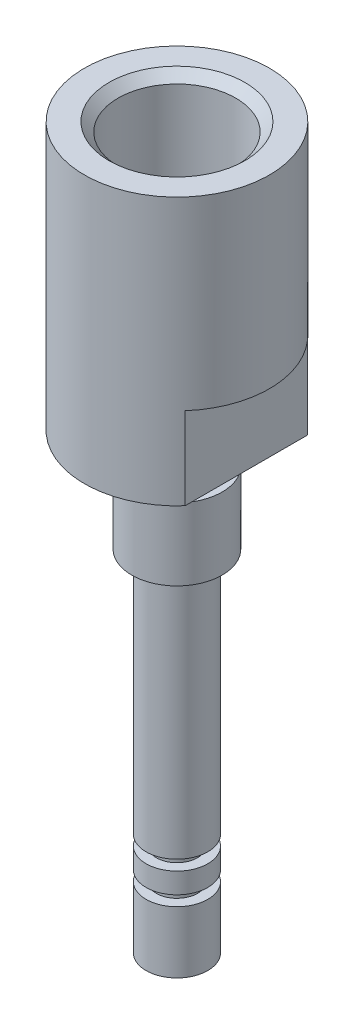
ISO-10303-21;
HEADER;
FILE_DESCRIPTION(('STEP AP214'),'2;1');
FILE_NAME('part.step','',(''),(''),'','','');
FILE_SCHEMA(('AUTOMOTIVE_DESIGN { 1 0 10303 214 1 1 1 1 }'));
ENDSEC;
DATA;
#1=APPLICATION_CONTEXT('core data for automotive mechanical design processes');
#2=APPLICATION_PROTOCOL_DEFINITION('international standard','automotive_design',2000,#1);
#3=PRODUCT_CONTEXT('',#1,'mechanical');
#4=PRODUCT('Part','Part','',(#3));
#5=PRODUCT_RELATED_PRODUCT_CATEGORY('part','',(#4));
#6=PRODUCT_DEFINITION_FORMATION('','',#4);
#7=PRODUCT_DEFINITION_CONTEXT('part definition',#1,'design');
#8=PRODUCT_DEFINITION('design','',#6,#7);
#9=PRODUCT_DEFINITION_SHAPE('','',#8);
#10=(LENGTH_UNIT() NAMED_UNIT(*) SI_UNIT(.MILLI.,.METRE.));
#11=(NAMED_UNIT(*) PLANE_ANGLE_UNIT() SI_UNIT($,.RADIAN.));
#12=(NAMED_UNIT(*) SI_UNIT($,.STERADIAN.) SOLID_ANGLE_UNIT());
#13=UNCERTAINTY_MEASURE_WITH_UNIT(LENGTH_MEASURE(1.E-05),#10,'distance_accuracy_value','');
#14=(GEOMETRIC_REPRESENTATION_CONTEXT(3) GLOBAL_UNCERTAINTY_ASSIGNED_CONTEXT((#13)) GLOBAL_UNIT_ASSIGNED_CONTEXT((#10,
#11,#12)) REPRESENTATION_CONTEXT('',''));
#15=CARTESIAN_POINT('',(0.,0.,0.));
#16=DIRECTION('',(0.,0.,1.));
#17=DIRECTION('',(1.,0.,0.));
#18=AXIS2_PLACEMENT_3D('',#15,#16,#17);
#19=CARTESIAN_POINT('',(-0.75,70.,0.));
#20=DIRECTION('',(0.,-1.,0.));
#21=DIRECTION('',(0.,0.,-1.));
#22=AXIS2_PLACEMENT_3D('',#19,#20,#21);
#23=PLANE('',#22);
#24=CARTESIAN_POINT('',(0.,70.,0.));
#25=DIRECTION('',(0.,-1.,0.));
#26=DIRECTION('',(0.,0.,-1.));
#27=AXIS2_PLACEMENT_3D('',#24,#25,#26);
#28=CIRCLE('',#27,9.);
#29=CARTESIAN_POINT('',(0.,70.,-9.));
#30=VERTEX_POINT('',#29);
#31=EDGE_CURVE('E116',#30,#30,#28,.T.);
#32=ORIENTED_EDGE('',*,*,#31,.F.);
#33=EDGE_LOOP('',(#32));
#34=FACE_BOUND('',#33,.T.);
#35=CARTESIAN_POINT('',(0.,70.,0.));
#36=DIRECTION('',(0.,1.,0.));
#37=DIRECTION('',(0.,0.,1.));
#38=AXIS2_PLACEMENT_3D('',#35,#36,#37);
#39=CIRCLE('',#38,6.6035);
#40=CARTESIAN_POINT('',(0.,70.,6.6035));
#41=VERTEX_POINT('',#40);
#42=EDGE_CURVE('E159',#41,#41,#39,.T.);
#43=ORIENTED_EDGE('',*,*,#42,.F.);
#44=EDGE_LOOP('',(#43));
#45=FACE_BOUND('',#44,.T.);
#46=ADVANCED_FACE('F47',(#34,#45),#23,.F.);
#47=CARTESIAN_POINT('',(0.,0.,0.));
#48=DIRECTION('',(0.,-1.,0.));
#49=DIRECTION('',(0.,0.,-1.));
#50=AXIS2_PLACEMENT_3D('',#47,#48,#49);
#51=CYLINDRICAL_SURFACE('',#50,0.75);
#52=CARTESIAN_POINT('',(0.,0.,0.));
#53=DIRECTION('',(0.,-1.,0.));
#54=DIRECTION('',(0.,0.,-1.));
#55=AXIS2_PLACEMENT_3D('',#52,#53,#54);
#56=CIRCLE('',#55,0.75);
#57=CARTESIAN_POINT('',(0.,0.,-0.75));
#58=VERTEX_POINT('',#57);
#59=EDGE_CURVE('E99',#58,#58,#56,.T.);
#60=ORIENTED_EDGE('',*,*,#59,.T.);
#61=EDGE_LOOP('',(#60));
#62=FACE_BOUND('',#61,.T.);
#63=CARTESIAN_POINT('',(0.,5.,0.));
#64=DIRECTION('',(0.,1.,0.));
#65=DIRECTION('',(0.,0.,1.));
#66=AXIS2_PLACEMENT_3D('',#63,#64,#65);
#67=CIRCLE('',#66,0.75);
#68=CARTESIAN_POINT('',(0.,5.,0.75));
#69=VERTEX_POINT('',#68);
#70=EDGE_CURVE('E128',#69,#69,#67,.F.);
#71=ORIENTED_EDGE('',*,*,#70,.F.);
#72=EDGE_LOOP('',(#71));
#73=FACE_BOUND('',#72,.T.);
#74=ADVANCED_FACE('F238',(#62,#73),#51,.F.);
#75=CARTESIAN_POINT('',(-3.,0.,0.));
#76=DIRECTION('',(0.,1.,0.));
#77=DIRECTION('',(0.,0.,1.));
#78=AXIS2_PLACEMENT_3D('',#75,#76,#77);
#79=PLANE('',#78);
#80=ORIENTED_EDGE('',*,*,#59,.F.);
#81=EDGE_LOOP('',(#80));
#82=FACE_BOUND('',#81,.T.);
#83=CARTESIAN_POINT('',(0.,0.,0.));
#84=DIRECTION('',(0.,-1.,0.));
#85=DIRECTION('',(0.,0.,-1.));
#86=AXIS2_PLACEMENT_3D('',#83,#84,#85);
#87=CIRCLE('',#86,3.);
#88=CARTESIAN_POINT('',(0.,0.,-3.));
#89=VERTEX_POINT('',#88);
#90=EDGE_CURVE('E132',#89,#89,#87,.T.);
#91=ORIENTED_EDGE('',*,*,#90,.T.);
#92=EDGE_LOOP('',(#91));
#93=FACE_BOUND('',#92,.T.);
#94=ADVANCED_FACE('F49',(#82,#93),#79,.F.);
#95=CARTESIAN_POINT('',(0.,0.,0.));
#96=DIRECTION('',(0.,-1.,0.));
#97=DIRECTION('',(0.,0.,-1.));
#98=AXIS2_PLACEMENT_3D('',#95,#96,#97);
#99=CYLINDRICAL_SURFACE('',#98,9.);
#100=CARTESIAN_POINT('',(0.,52.,0.));
#101=DIRECTION('',(0.,1.,0.));
#102=DIRECTION('',(0.,0.,1.));
#103=AXIS2_PLACEMENT_3D('',#100,#101,#102);
#104=CIRCLE('',#103,9.);
#105=CARTESIAN_POINT('',(-6.75,52.,-5.95294044989533));
#106=VERTEX_POINT('',#105);
#107=CARTESIAN_POINT('',(-6.75,52.,5.95294044989533));
#108=VERTEX_POINT('',#107);
#109=EDGE_CURVE('E12',#106,#108,#104,.T.);
#110=ORIENTED_EDGE('',*,*,#109,.T.);
#111=DIRECTION('',(0.,-1.,0.));
#112=VECTOR('',#111,1.);
#113=CARTESIAN_POINT('',(-6.75,0.,5.95294044989533));
#114=LINE('',#113,#112);
#115=CARTESIAN_POINT('',(-6.75,44.,5.95294044989532));
#116=VERTEX_POINT('',#115);
#117=EDGE_CURVE('E156',#108,#116,#114,.T.);
#118=ORIENTED_EDGE('',*,*,#117,.T.);
#119=CARTESIAN_POINT('',(0.,44.,0.));
#120=DIRECTION('',(0.,-1.,0.));
#121=DIRECTION('',(0.,0.,-1.));
#122=AXIS2_PLACEMENT_3D('',#119,#120,#121);
#123=CIRCLE('',#122,9.);
#124=CARTESIAN_POINT('',(6.75,44.,5.95294044989533));
#125=VERTEX_POINT('',#124);
#126=EDGE_CURVE('E111',#125,#116,#123,.T.);
#127=ORIENTED_EDGE('',*,*,#126,.F.);
#128=DIRECTION('',(0.,-1.,0.));
#129=VECTOR('',#128,1.);
#130=CARTESIAN_POINT('',(6.75,0.,5.95294044989533));
#131=LINE('',#130,#129);
#132=CARTESIAN_POINT('',(6.75,52.,5.95294044989533));
#133=VERTEX_POINT('',#132);
#134=EDGE_CURVE('E71',#125,#133,#131,.F.);
#135=ORIENTED_EDGE('',*,*,#134,.T.);
#136=CARTESIAN_POINT('',(0.,52.,0.));
#137=DIRECTION('',(0.,-1.,0.));
#138=DIRECTION('',(0.,0.,-1.));
#139=AXIS2_PLACEMENT_3D('',#136,#137,#138);
#140=CIRCLE('',#139,9.);
#141=CARTESIAN_POINT('',(6.75,52.,-5.95294044989533));
#142=VERTEX_POINT('',#141);
#143=EDGE_CURVE('E56',#142,#133,#140,.T.);
#144=ORIENTED_EDGE('',*,*,#143,.F.);
#145=DIRECTION('',(0.,-1.,0.));
#146=VECTOR('',#145,1.);
#147=CARTESIAN_POINT('',(6.75,0.,-5.95294044989533));
#148=LINE('',#147,#146);
#149=CARTESIAN_POINT('',(6.75,44.,-5.95294044989533));
#150=VERTEX_POINT('',#149);
#151=EDGE_CURVE('E91',#142,#150,#148,.T.);
#152=ORIENTED_EDGE('',*,*,#151,.T.);
#153=CARTESIAN_POINT('',(-6.75,44.,-5.95294044989532));
#154=VERTEX_POINT('',#153);
#155=EDGE_CURVE('E106',#154,#150,#123,.T.);
#156=ORIENTED_EDGE('',*,*,#155,.F.);
#157=DIRECTION('',(0.,-1.,0.));
#158=VECTOR('',#157,1.);
#159=CARTESIAN_POINT('',(-6.75,0.,-5.95294044989533));
#160=LINE('',#159,#158);
#161=EDGE_CURVE('E63',#154,#106,#160,.F.);
#162=ORIENTED_EDGE('',*,*,#161,.T.);
#163=EDGE_LOOP('',(#110,#118,#127,#135,#144,#152,#156,#162));
#164=FACE_BOUND('',#163,.T.);
#165=ORIENTED_EDGE('',*,*,#31,.T.);
#166=EDGE_LOOP('',(#165));
#167=FACE_BOUND('',#166,.T.);
#168=ADVANCED_FACE('F104',(#164,#167),#99,.T.);
#169=CARTESIAN_POINT('',(-9.,44.,0.));
#170=DIRECTION('',(0.,1.,0.));
#171=DIRECTION('',(0.,0.,1.));
#172=AXIS2_PLACEMENT_3D('',#169,#170,#171);
#173=PLANE('',#172);
#174=CARTESIAN_POINT('',(0.,44.,0.));
#175=DIRECTION('',(0.,-1.,0.));
#176=DIRECTION('',(0.,0.,-1.));
#177=AXIS2_PLACEMENT_3D('',#174,#175,#176);
#178=CIRCLE('',#177,3.);
#179=CARTESIAN_POINT('',(0.,44.,-3.));
#180=VERTEX_POINT('',#179);
#181=EDGE_CURVE('E112',#180,#180,#178,.T.);
#182=ORIENTED_EDGE('',*,*,#181,.F.);
#183=EDGE_LOOP('',(#182));
#184=FACE_BOUND('',#183,.T.);
#185=ORIENTED_EDGE('',*,*,#126,.T.);
#186=DIRECTION('',(0.,0.,-1.));
#187=VECTOR('',#186,1.);
#188=CARTESIAN_POINT('',(-6.75,44.,0.));
#189=LINE('',#188,#187);
#190=EDGE_CURVE('E98',#116,#154,#189,.T.);
#191=ORIENTED_EDGE('',*,*,#190,.T.);
#192=ORIENTED_EDGE('',*,*,#155,.T.);
#193=DIRECTION('',(0.,0.,1.));
#194=VECTOR('',#193,1.);
#195=CARTESIAN_POINT('',(6.75,44.,0.));
#196=LINE('',#195,#194);
#197=EDGE_CURVE('E88',#150,#125,#196,.T.);
#198=ORIENTED_EDGE('',*,*,#197,.T.);
#199=EDGE_LOOP('',(#185,#191,#192,#198));
#200=FACE_BOUND('',#199,.T.);
#201=ADVANCED_FACE('F109',(#184,#200),#173,.F.);
#202=CARTESIAN_POINT('',(0.,0.,0.));
#203=DIRECTION('',(0.,-1.,0.));
#204=DIRECTION('',(0.,0.,-1.));
#205=AXIS2_PLACEMENT_3D('',#202,#203,#204);
#206=CYLINDRICAL_SURFACE('',#205,3.);
#207=CARTESIAN_POINT('',(0.,41.,0.));
#208=DIRECTION('',(0.,-1.,0.));
#209=DIRECTION('',(0.,0.,-1.));
#210=AXIS2_PLACEMENT_3D('',#207,#208,#209);
#211=CIRCLE('',#210,3.);
#212=CARTESIAN_POINT('',(0.,41.,-3.));
#213=VERTEX_POINT('',#212);
#214=EDGE_CURVE('E118',#213,#213,#211,.T.);
#215=ORIENTED_EDGE('',*,*,#214,.F.);
#216=EDGE_LOOP('',(#215));
#217=FACE_BOUND('',#216,.T.);
#218=ORIENTED_EDGE('',*,*,#181,.T.);
#219=EDGE_LOOP('',(#218));
#220=FACE_BOUND('',#219,.T.);
#221=ADVANCED_FACE('F225',(#217,#220),#206,.T.);
#222=CARTESIAN_POINT('',(-4.39603960629369,41.,0.));
#223=DIRECTION('',(0.,-1.,0.));
#224=DIRECTION('',(0.,0.,-1.));
#225=AXIS2_PLACEMENT_3D('',#222,#223,#224);
#226=PLANE('',#225);
#227=CARTESIAN_POINT('',(0.,41.,0.));
#228=DIRECTION('',(0.,-1.,0.));
#229=DIRECTION('',(0.,0.,-1.));
#230=AXIS2_PLACEMENT_3D('',#227,#228,#229);
#231=CIRCLE('',#230,4.39603960629369);
#232=CARTESIAN_POINT('',(0.,41.,-4.39603960629369));
#233=VERTEX_POINT('',#232);
#234=EDGE_CURVE('E216',#233,#233,#231,.T.);
#235=ORIENTED_EDGE('',*,*,#234,.F.);
#236=EDGE_LOOP('',(#235));
#237=FACE_BOUND('',#236,.T.);
#238=ORIENTED_EDGE('',*,*,#214,.T.);
#239=EDGE_LOOP('',(#238));
#240=FACE_BOUND('',#239,.T.);
#241=ADVANCED_FACE('F223',(#237,#240),#226,.F.);
#242=CARTESIAN_POINT('',(0.,0.,0.));
#243=DIRECTION('',(0.,-1.,0.));
#244=DIRECTION('',(0.,0.,-1.));
#245=AXIS2_PLACEMENT_3D('',#242,#243,#244);
#246=CYLINDRICAL_SURFACE('',#245,4.39603960629369);
#247=CARTESIAN_POINT('',(0.,34.,0.));
#248=DIRECTION('',(0.,-1.,0.));
#249=DIRECTION('',(0.,0.,-1.));
#250=AXIS2_PLACEMENT_3D('',#247,#248,#249);
#251=CIRCLE('',#250,4.39603960629369);
#252=CARTESIAN_POINT('',(0.,34.,-4.39603960629369));
#253=VERTEX_POINT('',#252);
#254=EDGE_CURVE('E212',#253,#253,#251,.T.);
#255=ORIENTED_EDGE('',*,*,#254,.F.);
#256=EDGE_LOOP('',(#255));
#257=FACE_BOUND('',#256,.T.);
#258=ORIENTED_EDGE('',*,*,#234,.T.);
#259=EDGE_LOOP('',(#258));
#260=FACE_BOUND('',#259,.T.);
#261=ADVANCED_FACE('F315',(#257,#260),#246,.T.);
#262=CARTESIAN_POINT('',(-4.39603960629369,34.,0.));
#263=DIRECTION('',(0.,1.,0.));
#264=DIRECTION('',(0.,0.,1.));
#265=AXIS2_PLACEMENT_3D('',#262,#263,#264);
#266=PLANE('',#265);
#267=CARTESIAN_POINT('',(0.,34.,0.));
#268=DIRECTION('',(0.,-1.,0.));
#269=DIRECTION('',(0.,0.,-1.));
#270=AXIS2_PLACEMENT_3D('',#267,#268,#269);
#271=CIRCLE('',#270,3.);
#272=CARTESIAN_POINT('',(0.,34.,-3.));
#273=VERTEX_POINT('',#272);
#274=EDGE_CURVE('E208',#273,#273,#271,.T.);
#275=ORIENTED_EDGE('',*,*,#274,.F.);
#276=EDGE_LOOP('',(#275));
#277=FACE_BOUND('',#276,.T.);
#278=ORIENTED_EDGE('',*,*,#254,.T.);
#279=EDGE_LOOP('',(#278));
#280=FACE_BOUND('',#279,.T.);
#281=ADVANCED_FACE('F311',(#277,#280),#266,.F.);
#282=CARTESIAN_POINT('',(0.,0.,0.));
#283=DIRECTION('',(0.,-1.,0.));
#284=DIRECTION('',(0.,0.,-1.));
#285=AXIS2_PLACEMENT_3D('',#282,#283,#284);
#286=CYLINDRICAL_SURFACE('',#285,3.);
#287=CARTESIAN_POINT('',(0.,10.,0.));
#288=DIRECTION('',(0.,-1.,0.));
#289=DIRECTION('',(0.,0.,-1.));
#290=AXIS2_PLACEMENT_3D('',#287,#288,#289);
#291=CIRCLE('',#290,3.);
#292=CARTESIAN_POINT('',(0.,10.,-3.));
#293=VERTEX_POINT('',#292);
#294=EDGE_CURVE('E204',#293,#293,#291,.T.);
#295=ORIENTED_EDGE('',*,*,#294,.F.);
#296=EDGE_LOOP('',(#295));
#297=FACE_BOUND('',#296,.T.);
#298=ORIENTED_EDGE('',*,*,#274,.T.);
#299=EDGE_LOOP('',(#298));
#300=FACE_BOUND('',#299,.T.);
#301=ADVANCED_FACE('F307',(#297,#300),#286,.T.);
#302=CARTESIAN_POINT('',(-3.,10.,0.));
#303=DIRECTION('',(0.,1.,0.));
#304=DIRECTION('',(0.,0.,1.));
#305=AXIS2_PLACEMENT_3D('',#302,#303,#304);
#306=PLANE('',#305);
#307=CARTESIAN_POINT('',(0.,10.,0.));
#308=DIRECTION('',(0.,-1.,0.));
#309=DIRECTION('',(0.,0.,-1.));
#310=AXIS2_PLACEMENT_3D('',#307,#308,#309);
#311=CIRCLE('',#310,2.);
#312=CARTESIAN_POINT('',(0.,10.,-2.));
#313=VERTEX_POINT('',#312);
#314=EDGE_CURVE('E200',#313,#313,#311,.T.);
#315=ORIENTED_EDGE('',*,*,#314,.F.);
#316=EDGE_LOOP('',(#315));
#317=FACE_BOUND('',#316,.T.);
#318=ORIENTED_EDGE('',*,*,#294,.T.);
#319=EDGE_LOOP('',(#318));
#320=FACE_BOUND('',#319,.T.);
#321=ADVANCED_FACE('F303',(#317,#320),#306,.F.);
#322=CARTESIAN_POINT('',(0.,0.,0.));
#323=DIRECTION('',(0.,-1.,0.));
#324=DIRECTION('',(0.,0.,-1.));
#325=AXIS2_PLACEMENT_3D('',#322,#323,#324);
#326=CYLINDRICAL_SURFACE('',#325,2.);
#327=CARTESIAN_POINT('',(0.,9.,0.));
#328=DIRECTION('',(0.,-1.,0.));
#329=DIRECTION('',(0.,0.,-1.));
#330=AXIS2_PLACEMENT_3D('',#327,#328,#329);
#331=CIRCLE('',#330,2.);
#332=CARTESIAN_POINT('',(0.,9.,-2.));
#333=VERTEX_POINT('',#332);
#334=EDGE_CURVE('E196',#333,#333,#331,.T.);
#335=ORIENTED_EDGE('',*,*,#334,.F.);
#336=EDGE_LOOP('',(#335));
#337=FACE_BOUND('',#336,.T.);
#338=ORIENTED_EDGE('',*,*,#314,.T.);
#339=EDGE_LOOP('',(#338));
#340=FACE_BOUND('',#339,.T.);
#341=ADVANCED_FACE('F299',(#337,#340),#326,.T.);
#342=CARTESIAN_POINT('',(-2.,9.,0.));
#343=DIRECTION('',(0.,-1.,0.));
#344=DIRECTION('',(0.,0.,-1.));
#345=AXIS2_PLACEMENT_3D('',#342,#343,#344);
#346=PLANE('',#345);
#347=CARTESIAN_POINT('',(0.,9.,0.));
#348=DIRECTION('',(0.,-1.,0.));
#349=DIRECTION('',(0.,0.,-1.));
#350=AXIS2_PLACEMENT_3D('',#347,#348,#349);
#351=CIRCLE('',#350,3.);
#352=CARTESIAN_POINT('',(0.,9.,-3.));
#353=VERTEX_POINT('',#352);
#354=EDGE_CURVE('E192',#353,#353,#351,.T.);
#355=ORIENTED_EDGE('',*,*,#354,.F.);
#356=EDGE_LOOP('',(#355));
#357=FACE_BOUND('',#356,.T.);
#358=ORIENTED_EDGE('',*,*,#334,.T.);
#359=EDGE_LOOP('',(#358));
#360=FACE_BOUND('',#359,.T.);
#361=ADVANCED_FACE('F295',(#357,#360),#346,.F.);
#362=CARTESIAN_POINT('',(0.,0.,0.));
#363=DIRECTION('',(0.,-1.,0.));
#364=DIRECTION('',(0.,0.,-1.));
#365=AXIS2_PLACEMENT_3D('',#362,#363,#364);
#366=CYLINDRICAL_SURFACE('',#365,3.);
#367=CARTESIAN_POINT('',(0.,7.,0.));
#368=DIRECTION('',(0.,-1.,0.));
#369=DIRECTION('',(0.,0.,-1.));
#370=AXIS2_PLACEMENT_3D('',#367,#368,#369);
#371=CIRCLE('',#370,3.);
#372=CARTESIAN_POINT('',(0.,7.,-3.));
#373=VERTEX_POINT('',#372);
#374=EDGE_CURVE('E188',#373,#373,#371,.T.);
#375=ORIENTED_EDGE('',*,*,#374,.F.);
#376=EDGE_LOOP('',(#375));
#377=FACE_BOUND('',#376,.T.);
#378=ORIENTED_EDGE('',*,*,#354,.T.);
#379=EDGE_LOOP('',(#378));
#380=FACE_BOUND('',#379,.T.);
#381=ADVANCED_FACE('F291',(#377,#380),#366,.T.);
#382=CARTESIAN_POINT('',(-3.,7.,0.));
#383=DIRECTION('',(0.,1.,0.));
#384=DIRECTION('',(0.,0.,1.));
#385=AXIS2_PLACEMENT_3D('',#382,#383,#384);
#386=PLANE('',#385);
#387=CARTESIAN_POINT('',(0.,7.,0.));
#388=DIRECTION('',(0.,-1.,0.));
#389=DIRECTION('',(0.,0.,-1.));
#390=AXIS2_PLACEMENT_3D('',#387,#388,#389);
#391=CIRCLE('',#390,2.);
#392=CARTESIAN_POINT('',(0.,7.,-2.));
#393=VERTEX_POINT('',#392);
#394=EDGE_CURVE('E184',#393,#393,#391,.T.);
#395=ORIENTED_EDGE('',*,*,#394,.F.);
#396=EDGE_LOOP('',(#395));
#397=FACE_BOUND('',#396,.T.);
#398=ORIENTED_EDGE('',*,*,#374,.T.);
#399=EDGE_LOOP('',(#398));
#400=FACE_BOUND('',#399,.T.);
#401=ADVANCED_FACE('F287',(#397,#400),#386,.F.);
#402=CARTESIAN_POINT('',(0.,0.,0.));
#403=DIRECTION('',(0.,-1.,0.));
#404=DIRECTION('',(0.,0.,-1.));
#405=AXIS2_PLACEMENT_3D('',#402,#403,#404);
#406=CYLINDRICAL_SURFACE('',#405,2.);
#407=CARTESIAN_POINT('',(0.,6.,0.));
#408=DIRECTION('',(0.,-1.,0.));
#409=DIRECTION('',(0.,0.,-1.));
#410=AXIS2_PLACEMENT_3D('',#407,#408,#409);
#411=CIRCLE('',#410,2.);
#412=CARTESIAN_POINT('',(0.,6.,-2.));
#413=VERTEX_POINT('',#412);
#414=EDGE_CURVE('E180',#413,#413,#411,.T.);
#415=ORIENTED_EDGE('',*,*,#414,.F.);
#416=EDGE_LOOP('',(#415));
#417=FACE_BOUND('',#416,.T.);
#418=ORIENTED_EDGE('',*,*,#394,.T.);
#419=EDGE_LOOP('',(#418));
#420=FACE_BOUND('',#419,.T.);
#421=ADVANCED_FACE('F283',(#417,#420),#406,.T.);
#422=CARTESIAN_POINT('',(-2.,6.,0.));
#423=DIRECTION('',(0.,-1.,0.));
#424=DIRECTION('',(0.,0.,-1.));
#425=AXIS2_PLACEMENT_3D('',#422,#423,#424);
#426=PLANE('',#425);
#427=CARTESIAN_POINT('',(0.,6.,0.));
#428=DIRECTION('',(0.,-1.,0.));
#429=DIRECTION('',(0.,0.,-1.));
#430=AXIS2_PLACEMENT_3D('',#427,#428,#429);
#431=CIRCLE('',#430,3.);
#432=CARTESIAN_POINT('',(0.,6.,-3.));
#433=VERTEX_POINT('',#432);
#434=EDGE_CURVE('E176',#433,#433,#431,.T.);
#435=ORIENTED_EDGE('',*,*,#434,.F.);
#436=EDGE_LOOP('',(#435));
#437=FACE_BOUND('',#436,.T.);
#438=ORIENTED_EDGE('',*,*,#414,.T.);
#439=EDGE_LOOP('',(#438));
#440=FACE_BOUND('',#439,.T.);
#441=ADVANCED_FACE('F279',(#437,#440),#426,.F.);
#442=CARTESIAN_POINT('',(0.,0.,0.));
#443=DIRECTION('',(0.,-1.,0.));
#444=DIRECTION('',(0.,0.,-1.));
#445=AXIS2_PLACEMENT_3D('',#442,#443,#444);
#446=CYLINDRICAL_SURFACE('',#445,3.);
#447=ORIENTED_EDGE('',*,*,#90,.F.);
#448=EDGE_LOOP('',(#447));
#449=FACE_BOUND('',#448,.T.);
#450=ORIENTED_EDGE('',*,*,#434,.T.);
#451=EDGE_LOOP('',(#450));
#452=FACE_BOUND('',#451,.T.);
#453=ADVANCED_FACE('F272',(#449,#452),#446,.T.);
#454=CARTESIAN_POINT('',(-3.,5.,0.));
#455=DIRECTION('',(0.,1.,0.));
#456=DIRECTION('',(0.,0.,1.));
#457=AXIS2_PLACEMENT_3D('',#454,#455,#456);
#458=PLANE('',#457);
#459=CARTESIAN_POINT('',(0.,5.,0.));
#460=DIRECTION('',(0.,1.,0.));
#461=DIRECTION('',(0.,0.,1.));
#462=AXIS2_PLACEMENT_3D('',#459,#460,#461);
#463=CIRCLE('',#462,1.5);
#464=CARTESIAN_POINT('',(0.,5.,1.5));
#465=VERTEX_POINT('',#464);
#466=EDGE_CURVE('E133',#465,#465,#463,.F.);
#467=ORIENTED_EDGE('',*,*,#466,.F.);
#468=EDGE_LOOP('',(#467));
#469=FACE_BOUND('',#468,.T.);
#470=ORIENTED_EDGE('',*,*,#70,.T.);
#471=EDGE_LOOP('',(#470));
#472=FACE_BOUND('',#471,.T.);
#473=ADVANCED_FACE('F269',(#469,#472),#458,.T.);
#474=CARTESIAN_POINT('',(0.,-4.2426406871193,0.));
#475=DIRECTION('',(0.,1.,0.));
#476=DIRECTION('',(0.,0.,1.));
#477=AXIS2_PLACEMENT_3D('',#474,#475,#476);
#478=CYLINDRICAL_SURFACE('',#477,1.5);
#479=CARTESIAN_POINT('',(0.,45.4628660361561,0.));
#480=DIRECTION('',(0.,1.,0.));
#481=DIRECTION('',(0.,0.,1.));
#482=AXIS2_PLACEMENT_3D('',#479,#480,#481);
#483=CIRCLE('',#482,1.5);
#484=CARTESIAN_POINT('',(0.,45.4628660361561,1.5));
#485=VERTEX_POINT('',#484);
#486=EDGE_CURVE('E134',#485,#485,#483,.T.);
#487=ORIENTED_EDGE('',*,*,#486,.T.);
#488=EDGE_LOOP('',(#487));
#489=FACE_BOUND('',#488,.T.);
#490=ORIENTED_EDGE('',*,*,#466,.T.);
#491=EDGE_LOOP('',(#490));
#492=FACE_BOUND('',#491,.T.);
#493=ADVANCED_FACE('F267',(#489,#492),#478,.F.);
#494=CARTESIAN_POINT('',(0.,48.,0.));
#495=DIRECTION('',(0.,1.,0.));
#496=DIRECTION('',(0.,0.,1.));
#497=AXIS2_PLACEMENT_3D('',#494,#495,#496);
#498=CONICAL_SURFACE('',#497,5.72249999999999,1.02974425867665);
#499=CARTESIAN_POINT('',(0.,48.,0.));
#500=DIRECTION('',(0.,1.,0.));
#501=DIRECTION('',(0.,0.,1.));
#502=AXIS2_PLACEMENT_3D('',#499,#500,#501);
#503=CIRCLE('',#502,5.72249999999999);
#504=CARTESIAN_POINT('',(0.,48.,5.72249999999999));
#505=VERTEX_POINT('',#504);
#506=EDGE_CURVE('E137',#505,#505,#503,.T.);
#507=ORIENTED_EDGE('',*,*,#506,.T.);
#508=EDGE_LOOP('',(#507));
#509=FACE_BOUND('',#508,.T.);
#510=ORIENTED_EDGE('',*,*,#486,.F.);
#511=EDGE_LOOP('',(#510));
#512=FACE_BOUND('',#511,.T.);
#513=ADVANCED_FACE('F259',(#509,#512),#498,.F.);
#514=CARTESIAN_POINT('',(0.,70.,0.));
#515=DIRECTION('',(0.,1.,0.));
#516=DIRECTION('',(0.,0.,1.));
#517=AXIS2_PLACEMENT_3D('',#514,#515,#516);
#518=CYLINDRICAL_SURFACE('',#517,5.7225);
#519=ORIENTED_EDGE('',*,*,#506,.F.);
#520=EDGE_LOOP('',(#519));
#521=FACE_BOUND('',#520,.T.);
#522=CARTESIAN_POINT('',(0.,69.119,0.));
#523=DIRECTION('',(0.,1.,0.));
#524=DIRECTION('',(0.,0.,1.));
#525=AXIS2_PLACEMENT_3D('',#522,#523,#524);
#526=CIRCLE('',#525,5.7225);
#527=CARTESIAN_POINT('',(0.,69.119,5.7225));
#528=VERTEX_POINT('',#527);
#529=EDGE_CURVE('E163',#528,#528,#526,.T.);
#530=ORIENTED_EDGE('',*,*,#529,.T.);
#531=EDGE_LOOP('',(#530));
#532=FACE_BOUND('',#531,.T.);
#533=ADVANCED_FACE('F251',(#521,#532),#518,.F.);
#534=CARTESIAN_POINT('',(0.,70.,0.));
#535=DIRECTION('',(0.,1.,0.));
#536=DIRECTION('',(0.,0.,1.));
#537=AXIS2_PLACEMENT_3D('',#534,#535,#536);
#538=CONICAL_SURFACE('',#537,6.6035,0.785398163397455);
#539=ORIENTED_EDGE('',*,*,#529,.F.);
#540=EDGE_LOOP('',(#539));
#541=FACE_BOUND('',#540,.T.);
#542=ORIENTED_EDGE('',*,*,#42,.T.);
#543=EDGE_LOOP('',(#542));
#544=FACE_BOUND('',#543,.T.);
#545=ADVANCED_FACE('F249',(#541,#544),#538,.F.);
#546=CARTESIAN_POINT('',(0.,52.,0.));
#547=DIRECTION('',(0.,-1.,0.));
#548=DIRECTION('',(0.,0.,-1.));
#549=AXIS2_PLACEMENT_3D('',#546,#547,#548);
#550=PLANE('',#549);
#551=ORIENTED_EDGE('',*,*,#143,.T.);
#552=DIRECTION('',(0.,0.,-1.));
#553=VECTOR('',#552,1.);
#554=CARTESIAN_POINT('',(6.75,52.,-8.03566917245019));
#555=LINE('',#554,#553);
#556=EDGE_CURVE('E143',#133,#142,#555,.T.);
#557=ORIENTED_EDGE('',*,*,#556,.T.);
#558=EDGE_LOOP('',(#551,#557));
#559=FACE_BOUND('',#558,.T.);
#560=ADVANCED_FACE('F142',(#559),#550,.T.);
#561=CARTESIAN_POINT('',(6.75,52.,-8.03566917245019));
#562=DIRECTION('',(-1.,0.,0.));
#563=DIRECTION('',(0.,0.,1.));
#564=AXIS2_PLACEMENT_3D('',#561,#562,#563);
#565=PLANE('',#564);
#566=ORIENTED_EDGE('',*,*,#556,.F.);
#567=ORIENTED_EDGE('',*,*,#134,.F.);
#568=ORIENTED_EDGE('',*,*,#197,.F.);
#569=ORIENTED_EDGE('',*,*,#151,.F.);
#570=EDGE_LOOP('',(#566,#567,#568,#569));
#571=FACE_BOUND('',#570,.T.);
#572=ADVANCED_FACE('F90',(#571),#565,.F.);
#573=CARTESIAN_POINT('',(0.,52.,0.));
#574=DIRECTION('',(0.,1.,0.));
#575=DIRECTION('',(0.,0.,1.));
#576=AXIS2_PLACEMENT_3D('',#573,#574,#575);
#577=PLANE('',#576);
#578=DIRECTION('',(0.,0.,1.));
#579=VECTOR('',#578,1.);
#580=CARTESIAN_POINT('',(-6.75,52.,-8.03566917245019));
#581=LINE('',#580,#579);
#582=EDGE_CURVE('E145',#106,#108,#581,.T.);
#583=ORIENTED_EDGE('',*,*,#582,.T.);
#584=ORIENTED_EDGE('',*,*,#109,.F.);
#585=EDGE_LOOP('',(#583,#584));
#586=FACE_BOUND('',#585,.T.);
#587=ADVANCED_FACE('F431',(#586),#577,.F.);
#588=CARTESIAN_POINT('',(-6.75,52.,-8.03566917245019));
#589=DIRECTION('',(1.,0.,0.));
#590=DIRECTION('',(0.,0.,-1.));
#591=AXIS2_PLACEMENT_3D('',#588,#589,#590);
#592=PLANE('',#591);
#593=ORIENTED_EDGE('',*,*,#582,.F.);
#594=ORIENTED_EDGE('',*,*,#161,.F.);
#595=ORIENTED_EDGE('',*,*,#190,.F.);
#596=ORIENTED_EDGE('',*,*,#117,.F.);
#597=EDGE_LOOP('',(#593,#594,#595,#596));
#598=FACE_BOUND('',#597,.T.);
#599=ADVANCED_FACE('F439',(#598),#592,.F.);
#600=CLOSED_SHELL('',(#46,#74,#94,#168,#201,#221,#241,#261,#281,#301,#321,#341,#361,#381,#401,
#421,#441,#453,#473,#493,#513,#533,#545,#560,#572,#587,#599));
#601=MANIFOLD_SOLID_BREP('B2',#600);
#602=ADVANCED_BREP_SHAPE_REPRESENTATION('',(#18,#601),#14);
#603=SHAPE_DEFINITION_REPRESENTATION(#9,#602);
ENDSEC;
END-ISO-10303-21;
